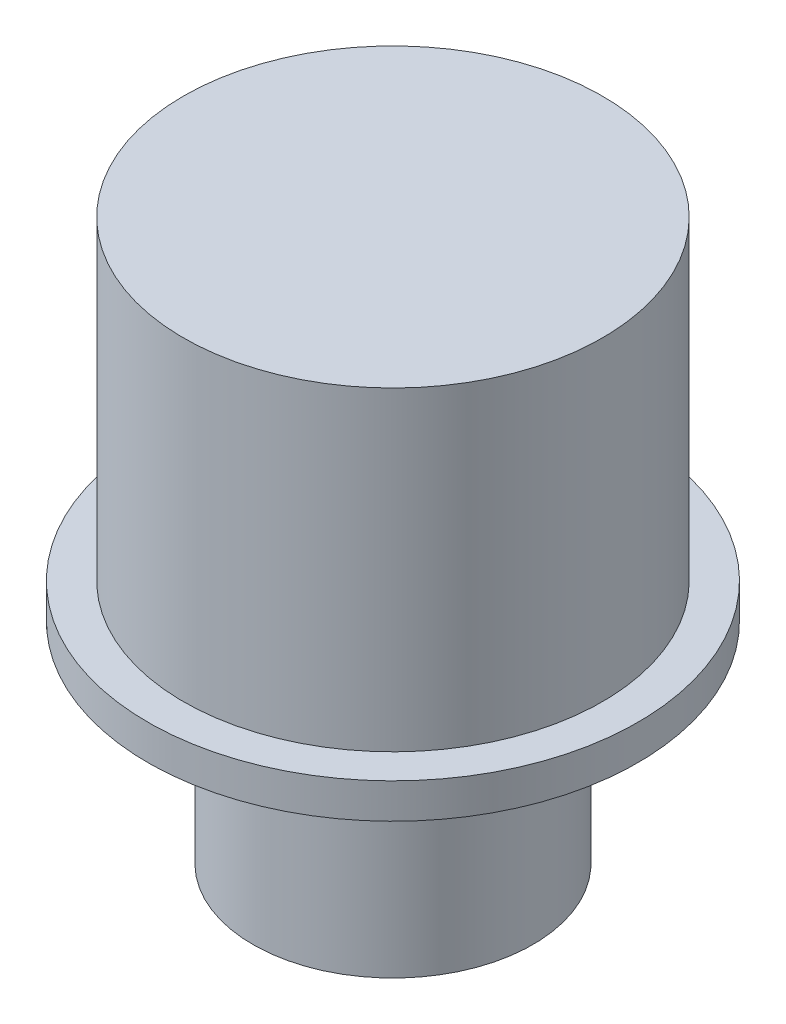
ISO-10303-21;
HEADER;
FILE_DESCRIPTION(('STEP AP214'),'2;1');
FILE_NAME('part.step','',(''),(''),'','','');
FILE_SCHEMA(('AUTOMOTIVE_DESIGN { 1 0 10303 214 1 1 1 1 }'));
ENDSEC;
DATA;
#1=APPLICATION_CONTEXT('core data for automotive mechanical design processes');
#2=APPLICATION_PROTOCOL_DEFINITION('international standard','automotive_design',2000,#1);
#3=PRODUCT_CONTEXT('',#1,'mechanical');
#4=PRODUCT('Part','Part','',(#3));
#5=PRODUCT_RELATED_PRODUCT_CATEGORY('part','',(#4));
#6=PRODUCT_DEFINITION_FORMATION('','',#4);
#7=PRODUCT_DEFINITION_CONTEXT('part definition',#1,'design');
#8=PRODUCT_DEFINITION('design','',#6,#7);
#9=PRODUCT_DEFINITION_SHAPE('','',#8);
#10=(LENGTH_UNIT() NAMED_UNIT(*) SI_UNIT(.MILLI.,.METRE.));
#11=(NAMED_UNIT(*) PLANE_ANGLE_UNIT() SI_UNIT($,.RADIAN.));
#12=(NAMED_UNIT(*) SI_UNIT($,.STERADIAN.) SOLID_ANGLE_UNIT());
#13=UNCERTAINTY_MEASURE_WITH_UNIT(LENGTH_MEASURE(1.E-05),#10,'distance_accuracy_value','');
#14=(GEOMETRIC_REPRESENTATION_CONTEXT(3) GLOBAL_UNCERTAINTY_ASSIGNED_CONTEXT((#13)) GLOBAL_UNIT_ASSIGNED_CONTEXT((#10,
#11,#12)) REPRESENTATION_CONTEXT('',''));
#15=CARTESIAN_POINT('',(0.,0.,0.));
#16=DIRECTION('',(0.,0.,1.));
#17=DIRECTION('',(1.,0.,0.));
#18=AXIS2_PLACEMENT_3D('',#15,#16,#17);
#19=CARTESIAN_POINT('',(0.,0.,0.));
#20=DIRECTION('',(0.,1.,0.));
#21=DIRECTION('',(-1.,0.,0.));
#22=AXIS2_PLACEMENT_3D('',#19,#20,#21);
#23=PLANE('',#22);
#24=CARTESIAN_POINT('',(0.,0.,0.));
#25=DIRECTION('',(0.,1.,0.));
#26=DIRECTION('',(-1.,0.,0.));
#27=AXIS2_PLACEMENT_3D('',#24,#25,#26);
#28=CIRCLE('',#27,12.7);
#29=CARTESIAN_POINT('',(-12.7,0.,0.));
#30=VERTEX_POINT('',#29);
#31=EDGE_CURVE('E10',#30,#30,#28,.T.);
#32=ORIENTED_EDGE('',*,*,#31,.F.);
#33=EDGE_LOOP('',(#32));
#34=FACE_BOUND('',#33,.T.);
#35=ADVANCED_FACE('F31',(#34),#23,.F.);
#36=CARTESIAN_POINT('',(0.,50.8,0.));
#37=DIRECTION('',(0.,1.,0.));
#38=DIRECTION('',(-1.,0.,0.));
#39=AXIS2_PLACEMENT_3D('',#36,#37,#38);
#40=CYLINDRICAL_SURFACE('',#39,12.7);
#41=CARTESIAN_POINT('',(0.,19.05,0.));
#42=DIRECTION('',(0.,1.,0.));
#43=DIRECTION('',(-1.,0.,0.));
#44=AXIS2_PLACEMENT_3D('',#41,#42,#43);
#45=CIRCLE('',#44,12.7);
#46=CARTESIAN_POINT('',(-12.7,19.05,0.));
#47=VERTEX_POINT('',#46);
#48=EDGE_CURVE('E37',#47,#47,#45,.T.);
#49=ORIENTED_EDGE('',*,*,#48,.F.);
#50=EDGE_LOOP('',(#49));
#51=FACE_BOUND('',#50,.T.);
#52=ORIENTED_EDGE('',*,*,#31,.T.);
#53=EDGE_LOOP('',(#52));
#54=FACE_BOUND('',#53,.T.);
#55=ADVANCED_FACE('F79',(#51,#54),#40,.T.);
#56=CARTESIAN_POINT('',(12.7,19.05,0.));
#57=DIRECTION('',(0.,1.,0.));
#58=DIRECTION('',(-1.,0.,0.));
#59=AXIS2_PLACEMENT_3D('',#56,#57,#58);
#60=PLANE('',#59);
#61=CARTESIAN_POINT('',(0.,19.05,0.));
#62=DIRECTION('',(0.,1.,0.));
#63=DIRECTION('',(-1.,0.,0.));
#64=AXIS2_PLACEMENT_3D('',#61,#62,#63);
#65=CIRCLE('',#64,22.225);
#66=CARTESIAN_POINT('',(-22.225,19.05,0.));
#67=VERTEX_POINT('',#66);
#68=EDGE_CURVE('E41',#67,#67,#65,.T.);
#69=ORIENTED_EDGE('',*,*,#68,.F.);
#70=EDGE_LOOP('',(#69));
#71=FACE_BOUND('',#70,.T.);
#72=ORIENTED_EDGE('',*,*,#48,.T.);
#73=EDGE_LOOP('',(#72));
#74=FACE_BOUND('',#73,.T.);
#75=ADVANCED_FACE('F74',(#71,#74),#60,.F.);
#76=CARTESIAN_POINT('',(0.,50.8,0.));
#77=DIRECTION('',(0.,1.,0.));
#78=DIRECTION('',(-1.,0.,0.));
#79=AXIS2_PLACEMENT_3D('',#76,#77,#78);
#80=CYLINDRICAL_SURFACE('',#79,22.225);
#81=CARTESIAN_POINT('',(0.,22.225,0.));
#82=DIRECTION('',(0.,1.,0.));
#83=DIRECTION('',(-1.,0.,0.));
#84=AXIS2_PLACEMENT_3D('',#81,#82,#83);
#85=CIRCLE('',#84,22.225);
#86=CARTESIAN_POINT('',(-22.225,22.225,0.));
#87=VERTEX_POINT('',#86);
#88=EDGE_CURVE('E45',#87,#87,#85,.T.);
#89=ORIENTED_EDGE('',*,*,#88,.F.);
#90=EDGE_LOOP('',(#89));
#91=FACE_BOUND('',#90,.T.);
#92=ORIENTED_EDGE('',*,*,#68,.T.);
#93=EDGE_LOOP('',(#92));
#94=FACE_BOUND('',#93,.T.);
#95=ADVANCED_FACE('F68',(#91,#94),#80,.T.);
#96=CARTESIAN_POINT('',(22.225,22.225,0.));
#97=DIRECTION('',(0.,-1.,0.));
#98=DIRECTION('',(1.,0.,0.));
#99=AXIS2_PLACEMENT_3D('',#96,#97,#98);
#100=PLANE('',#99);
#101=CARTESIAN_POINT('',(0.,22.225,0.));
#102=DIRECTION('',(0.,1.,0.));
#103=DIRECTION('',(-1.,0.,0.));
#104=AXIS2_PLACEMENT_3D('',#101,#102,#103);
#105=CIRCLE('',#104,19.);
#106=CARTESIAN_POINT('',(-19.,22.225,0.));
#107=VERTEX_POINT('',#106);
#108=EDGE_CURVE('E50',#107,#107,#105,.T.);
#109=ORIENTED_EDGE('',*,*,#108,.F.);
#110=EDGE_LOOP('',(#109));
#111=FACE_BOUND('',#110,.T.);
#112=ORIENTED_EDGE('',*,*,#88,.T.);
#113=EDGE_LOOP('',(#112));
#114=FACE_BOUND('',#113,.T.);
#115=ADVANCED_FACE('F62',(#111,#114),#100,.F.);
#116=CARTESIAN_POINT('',(0.,50.8,0.));
#117=DIRECTION('',(0.,1.,0.));
#118=DIRECTION('',(-1.,0.,0.));
#119=AXIS2_PLACEMENT_3D('',#116,#117,#118);
#120=CYLINDRICAL_SURFACE('',#119,19.);
#121=CARTESIAN_POINT('',(0.,50.8,0.));
#122=DIRECTION('',(0.,1.,0.));
#123=DIRECTION('',(-1.,0.,0.));
#124=AXIS2_PLACEMENT_3D('',#121,#122,#123);
#125=CIRCLE('',#124,19.);
#126=CARTESIAN_POINT('',(-19.,50.8,0.));
#127=VERTEX_POINT('',#126);
#128=EDGE_CURVE('E53',#127,#127,#125,.T.);
#129=ORIENTED_EDGE('',*,*,#128,.F.);
#130=EDGE_LOOP('',(#129));
#131=FACE_BOUND('',#130,.T.);
#132=ORIENTED_EDGE('',*,*,#108,.T.);
#133=EDGE_LOOP('',(#132));
#134=FACE_BOUND('',#133,.T.);
#135=ADVANCED_FACE('F59',(#131,#134),#120,.T.);
#136=CARTESIAN_POINT('',(19.,50.8,0.));
#137=DIRECTION('',(0.,-1.,0.));
#138=DIRECTION('',(1.,0.,0.));
#139=AXIS2_PLACEMENT_3D('',#136,#137,#138);
#140=PLANE('',#139);
#141=ORIENTED_EDGE('',*,*,#128,.T.);
#142=EDGE_LOOP('',(#141));
#143=FACE_BOUND('',#142,.T.);
#144=ADVANCED_FACE('F57',(#143),#140,.F.);
#145=CLOSED_SHELL('',(#35,#55,#75,#95,#115,#135,#144));
#146=MANIFOLD_SOLID_BREP('B2',#145);
#147=ADVANCED_BREP_SHAPE_REPRESENTATION('',(#18,#146),#14);
#148=SHAPE_DEFINITION_REPRESENTATION(#9,#147);
ENDSEC;
END-ISO-10303-21;
